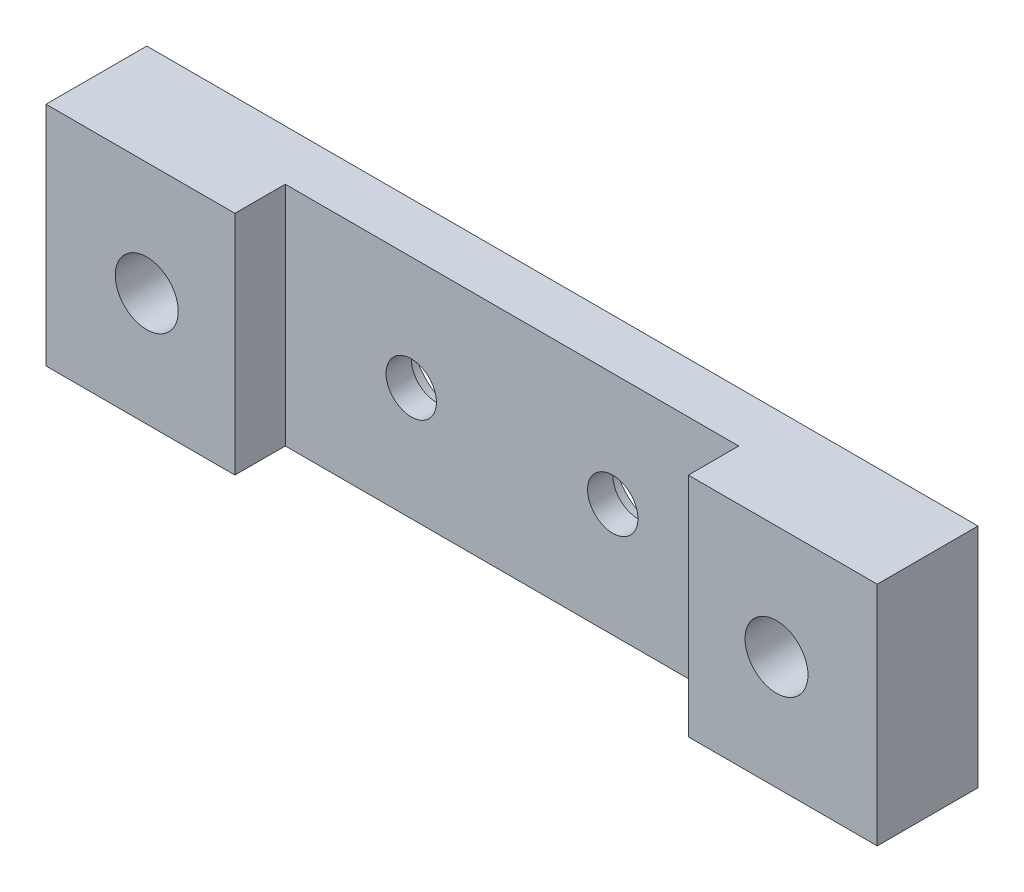
ISO-10303-21;
HEADER;
FILE_DESCRIPTION(('STEP AP214'),'2;1');
FILE_NAME('part.step','',(''),(''),'','','');
FILE_SCHEMA(('AUTOMOTIVE_DESIGN { 1 0 10303 214 1 1 1 1 }'));
ENDSEC;
DATA;
#1=APPLICATION_CONTEXT('core data for automotive mechanical design processes');
#2=APPLICATION_PROTOCOL_DEFINITION('international standard','automotive_design',2000,#1);
#3=PRODUCT_CONTEXT('',#1,'mechanical');
#4=PRODUCT('Part','Part','',(#3));
#5=PRODUCT_RELATED_PRODUCT_CATEGORY('part','',(#4));
#6=PRODUCT_DEFINITION_FORMATION('','',#4);
#7=PRODUCT_DEFINITION_CONTEXT('part definition',#1,'design');
#8=PRODUCT_DEFINITION('design','',#6,#7);
#9=PRODUCT_DEFINITION_SHAPE('','',#8);
#10=(LENGTH_UNIT() NAMED_UNIT(*) SI_UNIT(.MILLI.,.METRE.));
#11=(NAMED_UNIT(*) PLANE_ANGLE_UNIT() SI_UNIT($,.RADIAN.));
#12=(NAMED_UNIT(*) SI_UNIT($,.STERADIAN.) SOLID_ANGLE_UNIT());
#13=UNCERTAINTY_MEASURE_WITH_UNIT(LENGTH_MEASURE(1.E-05),#10,'distance_accuracy_value','');
#14=(GEOMETRIC_REPRESENTATION_CONTEXT(3) GLOBAL_UNCERTAINTY_ASSIGNED_CONTEXT((#13)) GLOBAL_UNIT_ASSIGNED_CONTEXT((#10,
#11,#12)) REPRESENTATION_CONTEXT('',''));
#15=CARTESIAN_POINT('',(0.,0.,0.));
#16=DIRECTION('',(0.,0.,1.));
#17=DIRECTION('',(1.,0.,0.));
#18=AXIS2_PLACEMENT_3D('',#15,#16,#17);
#19=CARTESIAN_POINT('',(-52.3875,28.575,12.7));
#20=DIRECTION('',(1.,0.,0.));
#21=DIRECTION('',(0.,0.,-1.));
#22=AXIS2_PLACEMENT_3D('',#19,#20,#21);
#23=PLANE('',#22);
#24=DIRECTION('',(0.,0.,1.));
#25=VECTOR('',#24,1.);
#26=CARTESIAN_POINT('',(-52.3875,0.,12.7));
#27=LINE('',#26,#25);
#28=CARTESIAN_POINT('',(-52.3875,0.,0.));
#29=VERTEX_POINT('',#28);
#30=CARTESIAN_POINT('',(-52.3875,0.,12.7));
#31=VERTEX_POINT('',#30);
#32=EDGE_CURVE('E130',#29,#31,#27,.T.);
#33=ORIENTED_EDGE('',*,*,#32,.T.);
#34=DIRECTION('',(0.,-1.,0.));
#35=VECTOR('',#34,1.);
#36=CARTESIAN_POINT('',(-52.3875,28.575,12.7));
#37=LINE('',#36,#35);
#38=CARTESIAN_POINT('',(-52.3875,28.575,12.7));
#39=VERTEX_POINT('',#38);
#40=EDGE_CURVE('E11',#39,#31,#37,.T.);
#41=ORIENTED_EDGE('',*,*,#40,.F.);
#42=DIRECTION('',(0.,0.,1.));
#43=VECTOR('',#42,1.);
#44=CARTESIAN_POINT('',(-52.3875,28.575,12.7));
#45=LINE('',#44,#43);
#46=CARTESIAN_POINT('',(-52.3875,28.575,0.));
#47=VERTEX_POINT('',#46);
#48=EDGE_CURVE('E145',#47,#39,#45,.T.);
#49=ORIENTED_EDGE('',*,*,#48,.F.);
#50=DIRECTION('',(0.,-1.,0.));
#51=VECTOR('',#50,1.);
#52=CARTESIAN_POINT('',(-52.3875,28.575,0.));
#53=LINE('',#52,#51);
#54=EDGE_CURVE('E126',#47,#29,#53,.T.);
#55=ORIENTED_EDGE('',*,*,#54,.T.);
#56=EDGE_LOOP('',(#33,#41,#49,#55));
#57=FACE_BOUND('',#56,.T.);
#58=ADVANCED_FACE('F32',(#57),#23,.F.);
#59=CARTESIAN_POINT('',(-28.575,28.575,12.7));
#60=DIRECTION('',(0.,0.,-1.));
#61=DIRECTION('',(-1.,0.,0.));
#62=AXIS2_PLACEMENT_3D('',#59,#60,#61);
#63=PLANE('',#62);
#64=CARTESIAN_POINT('',(-39.6875,14.2875,12.7));
#65=DIRECTION('',(0.,0.,1.));
#66=DIRECTION('',(1.,0.,0.));
#67=AXIS2_PLACEMENT_3D('',#64,#65,#66);
#68=CIRCLE('',#67,3.96875);
#69=CARTESIAN_POINT('',(-35.71875,14.2875,12.7));
#70=VERTEX_POINT('',#69);
#71=EDGE_CURVE('E238',#70,#70,#68,.T.);
#72=ORIENTED_EDGE('',*,*,#71,.F.);
#73=EDGE_LOOP('',(#72));
#74=FACE_BOUND('',#73,.T.);
#75=DIRECTION('',(1.,0.,0.));
#76=VECTOR('',#75,1.);
#77=CARTESIAN_POINT('',(-28.575,0.,12.7));
#78=LINE('',#77,#76);
#79=CARTESIAN_POINT('',(-28.575,0.,12.7));
#80=VERTEX_POINT('',#79);
#81=EDGE_CURVE('E133',#31,#80,#78,.T.);
#82=ORIENTED_EDGE('',*,*,#81,.T.);
#83=DIRECTION('',(0.,-1.,0.));
#84=VECTOR('',#83,1.);
#85=CARTESIAN_POINT('',(-28.575,28.575,12.7));
#86=LINE('',#85,#84);
#87=CARTESIAN_POINT('',(-28.575,28.575,12.7));
#88=VERTEX_POINT('',#87);
#89=EDGE_CURVE('E41',#88,#80,#86,.T.);
#90=ORIENTED_EDGE('',*,*,#89,.F.);
#91=DIRECTION('',(1.,0.,0.));
#92=VECTOR('',#91,1.);
#93=CARTESIAN_POINT('',(-28.575,28.575,12.7));
#94=LINE('',#93,#92);
#95=EDGE_CURVE('E93',#39,#88,#94,.T.);
#96=ORIENTED_EDGE('',*,*,#95,.F.);
#97=ORIENTED_EDGE('',*,*,#40,.T.);
#98=EDGE_LOOP('',(#82,#90,#96,#97));
#99=FACE_BOUND('',#98,.T.);
#100=ADVANCED_FACE('F206',(#74,#99),#63,.F.);
#101=CARTESIAN_POINT('',(-28.575,28.575,6.35000000000001));
#102=DIRECTION('',(-1.,0.,0.));
#103=DIRECTION('',(0.,0.,1.));
#104=AXIS2_PLACEMENT_3D('',#101,#102,#103);
#105=PLANE('',#104);
#106=DIRECTION('',(0.,0.,-1.));
#107=VECTOR('',#106,1.);
#108=CARTESIAN_POINT('',(-28.575,0.,6.35000000000001));
#109=LINE('',#108,#107);
#110=CARTESIAN_POINT('',(-28.575,0.,6.35000000000001));
#111=VERTEX_POINT('',#110);
#112=EDGE_CURVE('E136',#80,#111,#109,.T.);
#113=ORIENTED_EDGE('',*,*,#112,.T.);
#114=DIRECTION('',(0.,-1.,0.));
#115=VECTOR('',#114,1.);
#116=CARTESIAN_POINT('',(-28.575,28.575,6.35000000000001));
#117=LINE('',#116,#115);
#118=CARTESIAN_POINT('',(-28.575,28.575,6.35000000000001));
#119=VERTEX_POINT('',#118);
#120=EDGE_CURVE('E152',#119,#111,#117,.T.);
#121=ORIENTED_EDGE('',*,*,#120,.F.);
#122=DIRECTION('',(0.,0.,-1.));
#123=VECTOR('',#122,1.);
#124=CARTESIAN_POINT('',(-28.575,28.575,6.35000000000001));
#125=LINE('',#124,#123);
#126=EDGE_CURVE('E172',#88,#119,#125,.T.);
#127=ORIENTED_EDGE('',*,*,#126,.F.);
#128=ORIENTED_EDGE('',*,*,#89,.T.);
#129=EDGE_LOOP('',(#113,#121,#127,#128));
#130=FACE_BOUND('',#129,.T.);
#131=ADVANCED_FACE('F210',(#130),#105,.F.);
#132=CARTESIAN_POINT('',(28.575,28.575,6.35000000000001));
#133=DIRECTION('',(0.,0.,-1.));
#134=DIRECTION('',(-1.,0.,0.));
#135=AXIS2_PLACEMENT_3D('',#132,#133,#134);
#136=PLANE('',#135);
#137=CARTESIAN_POINT('',(12.7,14.2875,6.35000000000001));
#138=DIRECTION('',(0.,0.,-1.));
#139=DIRECTION('',(-1.,0.,0.));
#140=AXIS2_PLACEMENT_3D('',#137,#138,#139);
#141=CIRCLE('',#140,3.17500000000001);
#142=CARTESIAN_POINT('',(9.52499999999999,14.2875,6.35000000000001));
#143=VERTEX_POINT('',#142);
#144=EDGE_CURVE('E35',#143,#143,#141,.T.);
#145=ORIENTED_EDGE('',*,*,#144,.T.);
#146=EDGE_LOOP('',(#145));
#147=FACE_BOUND('',#146,.T.);
#148=CARTESIAN_POINT('',(-12.7,14.2875,6.35000000000001));
#149=DIRECTION('',(0.,0.,-1.));
#150=DIRECTION('',(-1.,0.,0.));
#151=AXIS2_PLACEMENT_3D('',#148,#149,#150);
#152=CIRCLE('',#151,3.17500000000001);
#153=CARTESIAN_POINT('',(-15.875,14.2875,6.35000000000001));
#154=VERTEX_POINT('',#153);
#155=EDGE_CURVE('E134',#154,#154,#152,.T.);
#156=ORIENTED_EDGE('',*,*,#155,.T.);
#157=EDGE_LOOP('',(#156));
#158=FACE_BOUND('',#157,.T.);
#159=DIRECTION('',(1.,0.,0.));
#160=VECTOR('',#159,1.);
#161=CARTESIAN_POINT('',(28.575,0.,6.35000000000001));
#162=LINE('',#161,#160);
#163=CARTESIAN_POINT('',(28.575,0.,6.35000000000001));
#164=VERTEX_POINT('',#163);
#165=EDGE_CURVE('E138',#111,#164,#162,.T.);
#166=ORIENTED_EDGE('',*,*,#165,.T.);
#167=DIRECTION('',(0.,-1.,0.));
#168=VECTOR('',#167,1.);
#169=CARTESIAN_POINT('',(28.575,28.575,6.35000000000001));
#170=LINE('',#169,#168);
#171=CARTESIAN_POINT('',(28.575,28.575,6.35000000000001));
#172=VERTEX_POINT('',#171);
#173=EDGE_CURVE('E149',#172,#164,#170,.T.);
#174=ORIENTED_EDGE('',*,*,#173,.F.);
#175=DIRECTION('',(1.,0.,0.));
#176=VECTOR('',#175,1.);
#177=CARTESIAN_POINT('',(28.575,28.575,6.35000000000001));
#178=LINE('',#177,#176);
#179=EDGE_CURVE('E174',#119,#172,#178,.T.);
#180=ORIENTED_EDGE('',*,*,#179,.F.);
#181=ORIENTED_EDGE('',*,*,#120,.T.);
#182=EDGE_LOOP('',(#166,#174,#180,#181));
#183=FACE_BOUND('',#182,.T.);
#184=ADVANCED_FACE('F180',(#147,#158,#183),#136,.F.);
#185=CARTESIAN_POINT('',(28.575,28.575,12.7));
#186=DIRECTION('',(1.,0.,0.));
#187=DIRECTION('',(0.,0.,-1.));
#188=AXIS2_PLACEMENT_3D('',#185,#186,#187);
#189=PLANE('',#188);
#190=DIRECTION('',(0.,0.,1.));
#191=VECTOR('',#190,1.);
#192=CARTESIAN_POINT('',(28.575,0.,12.7));
#193=LINE('',#192,#191);
#194=CARTESIAN_POINT('',(28.575,0.,12.7));
#195=VERTEX_POINT('',#194);
#196=EDGE_CURVE('E140',#164,#195,#193,.T.);
#197=ORIENTED_EDGE('',*,*,#196,.T.);
#198=DIRECTION('',(0.,-1.,0.));
#199=VECTOR('',#198,1.);
#200=CARTESIAN_POINT('',(28.575,28.575,12.7));
#201=LINE('',#200,#199);
#202=CARTESIAN_POINT('',(28.575,28.575,12.7));
#203=VERTEX_POINT('',#202);
#204=EDGE_CURVE('E121',#203,#195,#201,.T.);
#205=ORIENTED_EDGE('',*,*,#204,.F.);
#206=DIRECTION('',(0.,0.,1.));
#207=VECTOR('',#206,1.);
#208=CARTESIAN_POINT('',(28.575,28.575,12.7));
#209=LINE('',#208,#207);
#210=EDGE_CURVE('E112',#172,#203,#209,.T.);
#211=ORIENTED_EDGE('',*,*,#210,.F.);
#212=ORIENTED_EDGE('',*,*,#173,.T.);
#213=EDGE_LOOP('',(#197,#205,#211,#212));
#214=FACE_BOUND('',#213,.T.);
#215=ADVANCED_FACE('F184',(#214),#189,.F.);
#216=CARTESIAN_POINT('',(52.3875,28.575,12.7));
#217=DIRECTION('',(0.,0.,-1.));
#218=DIRECTION('',(-1.,0.,0.));
#219=AXIS2_PLACEMENT_3D('',#216,#217,#218);
#220=PLANE('',#219);
#221=CARTESIAN_POINT('',(39.6875,14.2875,12.7));
#222=DIRECTION('',(0.,0.,1.));
#223=DIRECTION('',(1.,0.,0.));
#224=AXIS2_PLACEMENT_3D('',#221,#222,#223);
#225=CIRCLE('',#224,3.96875);
#226=CARTESIAN_POINT('',(43.65625,14.2875,12.7));
#227=VERTEX_POINT('',#226);
#228=EDGE_CURVE('E230',#227,#227,#225,.T.);
#229=ORIENTED_EDGE('',*,*,#228,.F.);
#230=EDGE_LOOP('',(#229));
#231=FACE_BOUND('',#230,.T.);
#232=DIRECTION('',(1.,0.,0.));
#233=VECTOR('',#232,1.);
#234=CARTESIAN_POINT('',(52.3875,0.,12.7));
#235=LINE('',#234,#233);
#236=CARTESIAN_POINT('',(52.3875,0.,12.7));
#237=VERTEX_POINT('',#236);
#238=EDGE_CURVE('E120',#195,#237,#235,.T.);
#239=ORIENTED_EDGE('',*,*,#238,.T.);
#240=DIRECTION('',(0.,-1.,0.));
#241=VECTOR('',#240,1.);
#242=CARTESIAN_POINT('',(52.3875,28.575,12.7));
#243=LINE('',#242,#241);
#244=CARTESIAN_POINT('',(52.3875,28.575,12.7));
#245=VERTEX_POINT('',#244);
#246=EDGE_CURVE('E117',#245,#237,#243,.T.);
#247=ORIENTED_EDGE('',*,*,#246,.F.);
#248=DIRECTION('',(1.,0.,0.));
#249=VECTOR('',#248,1.);
#250=CARTESIAN_POINT('',(52.3875,28.575,12.7));
#251=LINE('',#250,#249);
#252=EDGE_CURVE('E106',#203,#245,#251,.T.);
#253=ORIENTED_EDGE('',*,*,#252,.F.);
#254=ORIENTED_EDGE('',*,*,#204,.T.);
#255=EDGE_LOOP('',(#239,#247,#253,#254));
#256=FACE_BOUND('',#255,.T.);
#257=ADVANCED_FACE('F118',(#231,#256),#220,.F.);
#258=CARTESIAN_POINT('',(52.3875,28.575,0.));
#259=DIRECTION('',(-1.,0.,0.));
#260=DIRECTION('',(0.,0.,1.));
#261=AXIS2_PLACEMENT_3D('',#258,#259,#260);
#262=PLANE('',#261);
#263=DIRECTION('',(0.,0.,-1.));
#264=VECTOR('',#263,1.);
#265=CARTESIAN_POINT('',(52.3875,0.,0.));
#266=LINE('',#265,#264);
#267=CARTESIAN_POINT('',(52.3875,0.,0.));
#268=VERTEX_POINT('',#267);
#269=EDGE_CURVE('E79',#237,#268,#266,.T.);
#270=ORIENTED_EDGE('',*,*,#269,.T.);
#271=DIRECTION('',(0.,-1.,0.));
#272=VECTOR('',#271,1.);
#273=CARTESIAN_POINT('',(52.3875,28.575,0.));
#274=LINE('',#273,#272);
#275=CARTESIAN_POINT('',(52.3875,28.575,0.));
#276=VERTEX_POINT('',#275);
#277=EDGE_CURVE('E122',#276,#268,#274,.T.);
#278=ORIENTED_EDGE('',*,*,#277,.F.);
#279=DIRECTION('',(0.,0.,-1.));
#280=VECTOR('',#279,1.);
#281=CARTESIAN_POINT('',(52.3875,28.575,0.));
#282=LINE('',#281,#280);
#283=EDGE_CURVE('E110',#245,#276,#282,.T.);
#284=ORIENTED_EDGE('',*,*,#283,.F.);
#285=ORIENTED_EDGE('',*,*,#246,.T.);
#286=EDGE_LOOP('',(#270,#278,#284,#285));
#287=FACE_BOUND('',#286,.T.);
#288=ADVANCED_FACE('F124',(#287),#262,.F.);
#289=CARTESIAN_POINT('',(-52.3875,28.575,0.));
#290=DIRECTION('',(0.,0.,1.));
#291=DIRECTION('',(1.,0.,0.));
#292=AXIS2_PLACEMENT_3D('',#289,#290,#291);
#293=PLANE('',#292);
#294=CARTESIAN_POINT('',(-39.6875,14.2875,0.));
#295=DIRECTION('',(0.,0.,1.));
#296=DIRECTION('',(1.,0.,0.));
#297=AXIS2_PLACEMENT_3D('',#294,#295,#296);
#298=CIRCLE('',#297,3.96874999999999);
#299=CARTESIAN_POINT('',(-35.71875,14.2875,0.));
#300=VERTEX_POINT('',#299);
#301=EDGE_CURVE('E233',#300,#300,#298,.T.);
#302=ORIENTED_EDGE('',*,*,#301,.T.);
#303=EDGE_LOOP('',(#302));
#304=FACE_BOUND('',#303,.T.);
#305=CARTESIAN_POINT('',(39.6875,14.2875,0.));
#306=DIRECTION('',(0.,0.,1.));
#307=DIRECTION('',(1.,0.,0.));
#308=AXIS2_PLACEMENT_3D('',#305,#306,#307);
#309=CIRCLE('',#308,3.96874999999999);
#310=CARTESIAN_POINT('',(43.65625,14.2875,0.));
#311=VERTEX_POINT('',#310);
#312=EDGE_CURVE('E232',#311,#311,#309,.T.);
#313=ORIENTED_EDGE('',*,*,#312,.T.);
#314=EDGE_LOOP('',(#313));
#315=FACE_BOUND('',#314,.T.);
#316=CARTESIAN_POINT('',(12.7,14.2875,0.));
#317=DIRECTION('',(0.,0.,-1.));
#318=DIRECTION('',(-1.,0.,0.));
#319=AXIS2_PLACEMENT_3D('',#316,#317,#318);
#320=CIRCLE('',#319,6.35);
#321=CARTESIAN_POINT('',(6.35,14.2875,0.));
#322=VERTEX_POINT('',#321);
#323=EDGE_CURVE('E236',#322,#322,#320,.T.);
#324=ORIENTED_EDGE('',*,*,#323,.F.);
#325=EDGE_LOOP('',(#324));
#326=FACE_BOUND('',#325,.T.);
#327=CARTESIAN_POINT('',(-12.7,14.2875,0.));
#328=DIRECTION('',(0.,0.,-1.));
#329=DIRECTION('',(-1.,0.,0.));
#330=AXIS2_PLACEMENT_3D('',#327,#328,#329);
#331=CIRCLE('',#330,6.35);
#332=CARTESIAN_POINT('',(-19.05,14.2875,0.));
#333=VERTEX_POINT('',#332);
#334=EDGE_CURVE('E166',#333,#333,#331,.T.);
#335=ORIENTED_EDGE('',*,*,#334,.F.);
#336=EDGE_LOOP('',(#335));
#337=FACE_BOUND('',#336,.T.);
#338=DIRECTION('',(-1.,0.,0.));
#339=VECTOR('',#338,1.);
#340=CARTESIAN_POINT('',(-52.3875,0.,0.));
#341=LINE('',#340,#339);
#342=EDGE_CURVE('E85',#268,#29,#341,.T.);
#343=ORIENTED_EDGE('',*,*,#342,.T.);
#344=ORIENTED_EDGE('',*,*,#54,.F.);
#345=DIRECTION('',(-1.,0.,0.));
#346=VECTOR('',#345,1.);
#347=CARTESIAN_POINT('',(-52.3875,28.575,0.));
#348=LINE('',#347,#346);
#349=EDGE_CURVE('E50',#276,#47,#348,.T.);
#350=ORIENTED_EDGE('',*,*,#349,.F.);
#351=ORIENTED_EDGE('',*,*,#277,.T.);
#352=EDGE_LOOP('',(#343,#344,#350,#351));
#353=FACE_BOUND('',#352,.T.);
#354=ADVANCED_FACE('F192',(#304,#315,#326,#337,#353),#293,.F.);
#355=CARTESIAN_POINT('',(0.,28.575,0.));
#356=DIRECTION('',(0.,-1.,0.));
#357=DIRECTION('',(0.,0.,-1.));
#358=AXIS2_PLACEMENT_3D('',#355,#356,#357);
#359=PLANE('',#358);
#360=ORIENTED_EDGE('',*,*,#48,.T.);
#361=ORIENTED_EDGE('',*,*,#95,.T.);
#362=ORIENTED_EDGE('',*,*,#126,.T.);
#363=ORIENTED_EDGE('',*,*,#179,.T.);
#364=ORIENTED_EDGE('',*,*,#210,.T.);
#365=ORIENTED_EDGE('',*,*,#252,.T.);
#366=ORIENTED_EDGE('',*,*,#283,.T.);
#367=ORIENTED_EDGE('',*,*,#349,.T.);
#368=EDGE_LOOP('',(#360,#361,#362,#363,#364,#365,#366,#367));
#369=FACE_BOUND('',#368,.T.);
#370=ADVANCED_FACE('F108',(#369),#359,.F.);
#371=CARTESIAN_POINT('',(0.,0.,0.));
#372=DIRECTION('',(0.,-1.,0.));
#373=DIRECTION('',(0.,0.,-1.));
#374=AXIS2_PLACEMENT_3D('',#371,#372,#373);
#375=PLANE('',#374);
#376=ORIENTED_EDGE('',*,*,#32,.F.);
#377=ORIENTED_EDGE('',*,*,#342,.F.);
#378=ORIENTED_EDGE('',*,*,#269,.F.);
#379=ORIENTED_EDGE('',*,*,#238,.F.);
#380=ORIENTED_EDGE('',*,*,#196,.F.);
#381=ORIENTED_EDGE('',*,*,#165,.F.);
#382=ORIENTED_EDGE('',*,*,#112,.F.);
#383=ORIENTED_EDGE('',*,*,#81,.F.);
#384=EDGE_LOOP('',(#376,#377,#378,#379,#380,#381,#382,#383));
#385=FACE_BOUND('',#384,.T.);
#386=ADVANCED_FACE('F187',(#385),#375,.T.);
#387=CARTESIAN_POINT('',(-12.7,14.2875,0.));
#388=DIRECTION('',(0.,0.,-1.));
#389=DIRECTION('',(-1.,0.,0.));
#390=AXIS2_PLACEMENT_3D('',#387,#388,#389);
#391=CYLINDRICAL_SURFACE('',#390,3.17500000000001);
#392=CARTESIAN_POINT('',(-12.7,14.2875,3.175));
#393=DIRECTION('',(0.,0.,-1.));
#394=DIRECTION('',(-1.,0.,0.));
#395=AXIS2_PLACEMENT_3D('',#392,#393,#394);
#396=CIRCLE('',#395,3.17500000000001);
#397=CARTESIAN_POINT('',(-15.875,14.2875,3.175));
#398=VERTEX_POINT('',#397);
#399=EDGE_CURVE('E157',#398,#398,#396,.T.);
#400=ORIENTED_EDGE('',*,*,#399,.T.);
#401=EDGE_LOOP('',(#400));
#402=FACE_BOUND('',#401,.T.);
#403=ORIENTED_EDGE('',*,*,#155,.F.);
#404=EDGE_LOOP('',(#403));
#405=FACE_BOUND('',#404,.T.);
#406=ADVANCED_FACE('F275',(#402,#405),#391,.F.);
#407=CARTESIAN_POINT('',(-9.52499999999999,14.2875,3.175));
#408=DIRECTION('',(0.,0.,1.));
#409=DIRECTION('',(1.,0.,0.));
#410=AXIS2_PLACEMENT_3D('',#407,#408,#409);
#411=PLANE('',#410);
#412=ORIENTED_EDGE('',*,*,#399,.F.);
#413=EDGE_LOOP('',(#412));
#414=FACE_BOUND('',#413,.T.);
#415=CARTESIAN_POINT('',(-12.7,14.2875,3.175));
#416=DIRECTION('',(0.,0.,-1.));
#417=DIRECTION('',(-1.,0.,0.));
#418=AXIS2_PLACEMENT_3D('',#415,#416,#417);
#419=CIRCLE('',#418,6.35);
#420=CARTESIAN_POINT('',(-19.05,14.2875,3.175));
#421=VERTEX_POINT('',#420);
#422=EDGE_CURVE('E161',#421,#421,#419,.T.);
#423=ORIENTED_EDGE('',*,*,#422,.T.);
#424=EDGE_LOOP('',(#423));
#425=FACE_BOUND('',#424,.T.);
#426=ADVANCED_FACE('F268',(#414,#425),#411,.F.);
#427=CARTESIAN_POINT('',(-12.7,14.2875,0.));
#428=DIRECTION('',(0.,0.,-1.));
#429=DIRECTION('',(-1.,0.,0.));
#430=AXIS2_PLACEMENT_3D('',#427,#428,#429);
#431=CYLINDRICAL_SURFACE('',#430,6.35);
#432=ORIENTED_EDGE('',*,*,#422,.F.);
#433=EDGE_LOOP('',(#432));
#434=FACE_BOUND('',#433,.T.);
#435=ORIENTED_EDGE('',*,*,#334,.T.);
#436=EDGE_LOOP('',(#435));
#437=FACE_BOUND('',#436,.T.);
#438=ADVANCED_FACE('F258',(#434,#437),#431,.F.);
#439=CARTESIAN_POINT('',(12.7,14.2875,0.));
#440=DIRECTION('',(0.,0.,-1.));
#441=DIRECTION('',(-1.,0.,0.));
#442=AXIS2_PLACEMENT_3D('',#439,#440,#441);
#443=CYLINDRICAL_SURFACE('',#442,3.17500000000001);
#444=CARTESIAN_POINT('',(12.7,14.2875,3.17499999999999));
#445=DIRECTION('',(0.,0.,-1.));
#446=DIRECTION('',(-1.,0.,0.));
#447=AXIS2_PLACEMENT_3D('',#444,#445,#446);
#448=CIRCLE('',#447,3.17500000000001);
#449=CARTESIAN_POINT('',(9.52499999999999,14.2875,3.17499999999999));
#450=VERTEX_POINT('',#449);
#451=EDGE_CURVE('E247',#450,#450,#448,.T.);
#452=ORIENTED_EDGE('',*,*,#451,.T.);
#453=EDGE_LOOP('',(#452));
#454=FACE_BOUND('',#453,.T.);
#455=ORIENTED_EDGE('',*,*,#144,.F.);
#456=EDGE_LOOP('',(#455));
#457=FACE_BOUND('',#456,.T.);
#458=ADVANCED_FACE('F255',(#454,#457),#443,.F.);
#459=CARTESIAN_POINT('',(15.875,14.2875,3.175));
#460=DIRECTION('',(0.,0.,1.));
#461=DIRECTION('',(1.,0.,0.));
#462=AXIS2_PLACEMENT_3D('',#459,#460,#461);
#463=PLANE('',#462);
#464=ORIENTED_EDGE('',*,*,#451,.F.);
#465=EDGE_LOOP('',(#464));
#466=FACE_BOUND('',#465,.T.);
#467=CARTESIAN_POINT('',(12.7,14.2875,3.175));
#468=DIRECTION('',(0.,0.,-1.));
#469=DIRECTION('',(-1.,0.,0.));
#470=AXIS2_PLACEMENT_3D('',#467,#468,#469);
#471=CIRCLE('',#470,6.35);
#472=CARTESIAN_POINT('',(6.35,14.2875,3.175));
#473=VERTEX_POINT('',#472);
#474=EDGE_CURVE('E244',#473,#473,#471,.T.);
#475=ORIENTED_EDGE('',*,*,#474,.T.);
#476=EDGE_LOOP('',(#475));
#477=FACE_BOUND('',#476,.T.);
#478=ADVANCED_FACE('F257',(#466,#477),#463,.F.);
#479=CARTESIAN_POINT('',(12.7,14.2875,0.));
#480=DIRECTION('',(0.,0.,-1.));
#481=DIRECTION('',(-1.,0.,0.));
#482=AXIS2_PLACEMENT_3D('',#479,#480,#481);
#483=CYLINDRICAL_SURFACE('',#482,6.35);
#484=ORIENTED_EDGE('',*,*,#474,.F.);
#485=EDGE_LOOP('',(#484));
#486=FACE_BOUND('',#485,.T.);
#487=ORIENTED_EDGE('',*,*,#323,.T.);
#488=EDGE_LOOP('',(#487));
#489=FACE_BOUND('',#488,.T.);
#490=ADVANCED_FACE('F265',(#486,#489),#483,.F.);
#491=CARTESIAN_POINT('',(39.6875,14.2875,12.7));
#492=DIRECTION('',(0.,0.,1.));
#493=DIRECTION('',(1.,0.,0.));
#494=AXIS2_PLACEMENT_3D('',#491,#492,#493);
#495=CYLINDRICAL_SURFACE('',#494,3.96875);
#496=ORIENTED_EDGE('',*,*,#312,.F.);
#497=EDGE_LOOP('',(#496));
#498=FACE_BOUND('',#497,.T.);
#499=ORIENTED_EDGE('',*,*,#228,.T.);
#500=EDGE_LOOP('',(#499));
#501=FACE_BOUND('',#500,.T.);
#502=ADVANCED_FACE('F314',(#498,#501),#495,.F.);
#503=CARTESIAN_POINT('',(-39.6875,14.2875,12.7));
#504=DIRECTION('',(0.,0.,1.));
#505=DIRECTION('',(1.,0.,0.));
#506=AXIS2_PLACEMENT_3D('',#503,#504,#505);
#507=CYLINDRICAL_SURFACE('',#506,3.96875);
#508=ORIENTED_EDGE('',*,*,#301,.F.);
#509=EDGE_LOOP('',(#508));
#510=FACE_BOUND('',#509,.T.);
#511=ORIENTED_EDGE('',*,*,#71,.T.);
#512=EDGE_LOOP('',(#511));
#513=FACE_BOUND('',#512,.T.);
#514=ADVANCED_FACE('F341',(#510,#513),#507,.F.);
#515=CLOSED_SHELL('',(#58,#100,#131,#184,#215,#257,#288,#354,#370,#386,#406,#426,#438,#458,#478,
#490,#502,#514));
#516=MANIFOLD_SOLID_BREP('B2',#515);
#517=ADVANCED_BREP_SHAPE_REPRESENTATION('',(#18,#516),#14);
#518=SHAPE_DEFINITION_REPRESENTATION(#9,#517);
ENDSEC;
END-ISO-10303-21;
